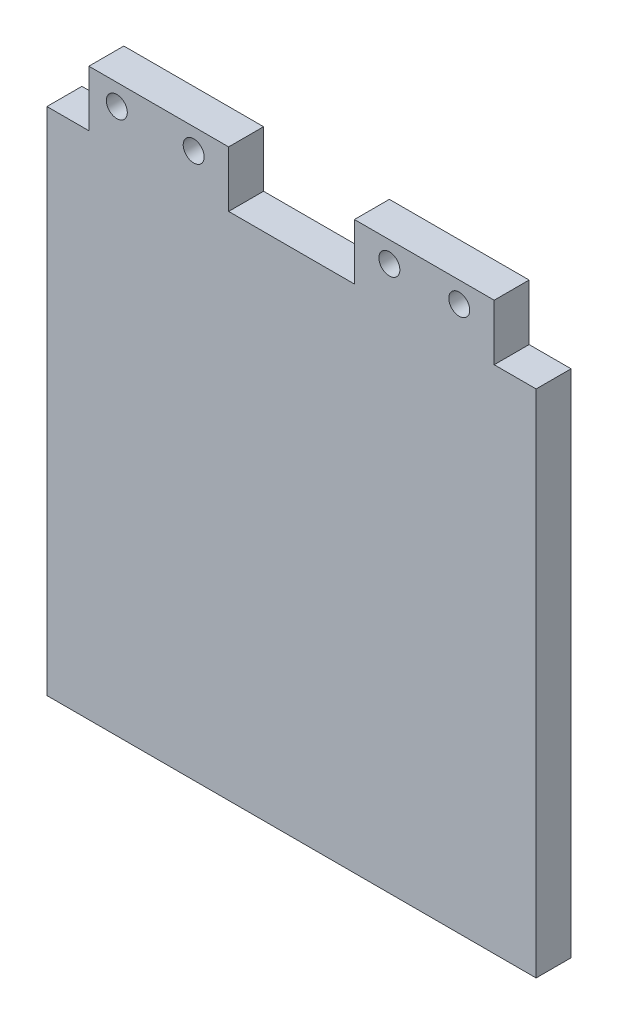
ISO-10303-21;
HEADER;
FILE_DESCRIPTION(('STEP AP214'),'2;1');
FILE_NAME('part.step','',(''),(''),'','','');
FILE_SCHEMA(('AUTOMOTIVE_DESIGN { 1 0 10303 214 1 1 1 1 }'));
ENDSEC;
DATA;
#1=APPLICATION_CONTEXT('core data for automotive mechanical design processes');
#2=APPLICATION_PROTOCOL_DEFINITION('international standard','automotive_design',2000,#1);
#3=PRODUCT_CONTEXT('',#1,'mechanical');
#4=PRODUCT('Part','Part','',(#3));
#5=PRODUCT_RELATED_PRODUCT_CATEGORY('part','',(#4));
#6=PRODUCT_DEFINITION_FORMATION('','',#4);
#7=PRODUCT_DEFINITION_CONTEXT('part definition',#1,'design');
#8=PRODUCT_DEFINITION('design','',#6,#7);
#9=PRODUCT_DEFINITION_SHAPE('','',#8);
#10=(LENGTH_UNIT() NAMED_UNIT(*) SI_UNIT(.MILLI.,.METRE.));
#11=(NAMED_UNIT(*) PLANE_ANGLE_UNIT() SI_UNIT($,.RADIAN.));
#12=(NAMED_UNIT(*) SI_UNIT($,.STERADIAN.) SOLID_ANGLE_UNIT());
#13=UNCERTAINTY_MEASURE_WITH_UNIT(LENGTH_MEASURE(1.E-05),#10,'distance_accuracy_value','');
#14=(GEOMETRIC_REPRESENTATION_CONTEXT(3) GLOBAL_UNCERTAINTY_ASSIGNED_CONTEXT((#13)) GLOBAL_UNIT_ASSIGNED_CONTEXT((#10,
#11,#12)) REPRESENTATION_CONTEXT('',''));
#15=CARTESIAN_POINT('',(0.,0.,0.));
#16=DIRECTION('',(0.,0.,1.));
#17=DIRECTION('',(1.,0.,0.));
#18=AXIS2_PLACEMENT_3D('',#15,#16,#17);
#19=CARTESIAN_POINT('',(-1.55698672911795,38.1428571428572,5.));
#20=DIRECTION('',(-1.,0.,0.));
#21=DIRECTION('',(0.,0.,1.));
#22=AXIS2_PLACEMENT_3D('',#19,#20,#21);
#23=PLANE('',#22);
#24=DIRECTION('',(0.,1.,0.));
#25=VECTOR('',#24,1.);
#26=CARTESIAN_POINT('',(-1.55698672911795,38.1428571428572,0.));
#27=LINE('',#26,#25);
#28=CARTESIAN_POINT('',(-1.55698672911795,38.1428571428572,0.));
#29=VERTEX_POINT('',#28);
#30=CARTESIAN_POINT('',(-1.55698672911795,46.1428571428572,0.));
#31=VERTEX_POINT('',#30);
#32=EDGE_CURVE('E154',#29,#31,#27,.T.);
#33=ORIENTED_EDGE('',*,*,#32,.T.);
#34=DIRECTION('',(0.,0.,-1.));
#35=VECTOR('',#34,1.);
#36=CARTESIAN_POINT('',(-1.55698672911795,46.1428571428572,5.));
#37=LINE('',#36,#35);
#38=CARTESIAN_POINT('',(-1.55698672911795,46.1428571428572,5.));
#39=VERTEX_POINT('',#38);
#40=EDGE_CURVE('E11',#39,#31,#37,.T.);
#41=ORIENTED_EDGE('',*,*,#40,.F.);
#42=DIRECTION('',(0.,1.,0.));
#43=VECTOR('',#42,1.);
#44=CARTESIAN_POINT('',(-1.55698672911795,38.1428571428572,5.));
#45=LINE('',#44,#43);
#46=CARTESIAN_POINT('',(-1.55698672911795,38.1428571428572,5.));
#47=VERTEX_POINT('',#46);
#48=EDGE_CURVE('E100',#47,#39,#45,.T.);
#49=ORIENTED_EDGE('',*,*,#48,.F.);
#50=DIRECTION('',(0.,0.,-1.));
#51=VECTOR('',#50,1.);
#52=CARTESIAN_POINT('',(-1.55698672911795,38.1428571428572,5.));
#53=LINE('',#52,#51);
#54=EDGE_CURVE('E51',#47,#29,#53,.T.);
#55=ORIENTED_EDGE('',*,*,#54,.T.);
#56=EDGE_LOOP('',(#33,#41,#49,#55));
#57=FACE_BOUND('',#56,.T.);
#58=ADVANCED_FACE('F33',(#57),#23,.F.);
#59=CARTESIAN_POINT('',(-21.5569867291179,46.1428571428572,5.));
#60=DIRECTION('',(0.,1.,0.));
#61=DIRECTION('',(0.,0.,1.));
#62=AXIS2_PLACEMENT_3D('',#59,#60,#61);
#63=PLANE('',#62);
#64=DIRECTION('',(1.,0.,0.));
#65=VECTOR('',#64,1.);
#66=CARTESIAN_POINT('',(-21.5569867291179,46.1428571428572,0.));
#67=LINE('',#66,#65);
#68=CARTESIAN_POINT('',(-21.5569867291179,46.1428571428572,0.));
#69=VERTEX_POINT('',#68);
#70=EDGE_CURVE('E156',#69,#31,#67,.T.);
#71=ORIENTED_EDGE('',*,*,#70,.F.);
#72=DIRECTION('',(0.,0.,-1.));
#73=VECTOR('',#72,1.);
#74=CARTESIAN_POINT('',(-21.5569867291179,46.1428571428572,5.));
#75=LINE('',#74,#73);
#76=CARTESIAN_POINT('',(-21.5569867291179,46.1428571428572,5.));
#77=VERTEX_POINT('',#76);
#78=EDGE_CURVE('E42',#77,#69,#75,.T.);
#79=ORIENTED_EDGE('',*,*,#78,.F.);
#80=DIRECTION('',(1.,0.,0.));
#81=VECTOR('',#80,1.);
#82=CARTESIAN_POINT('',(-21.5569867291179,46.1428571428572,5.));
#83=LINE('',#82,#81);
#84=EDGE_CURVE('E216',#77,#39,#83,.T.);
#85=ORIENTED_EDGE('',*,*,#84,.T.);
#86=ORIENTED_EDGE('',*,*,#40,.T.);
#87=EDGE_LOOP('',(#71,#79,#85,#86));
#88=FACE_BOUND('',#87,.T.);
#89=ADVANCED_FACE('F260',(#88),#63,.T.);
#90=CARTESIAN_POINT('',(-21.5569867291179,38.1428571428572,5.));
#91=DIRECTION('',(-1.,0.,0.));
#92=DIRECTION('',(0.,-1.,0.));
#93=AXIS2_PLACEMENT_3D('',#90,#91,#92);
#94=PLANE('',#93);
#95=DIRECTION('',(0.,1.,0.));
#96=VECTOR('',#95,1.);
#97=CARTESIAN_POINT('',(-21.5569867291179,38.1428571428572,0.));
#98=LINE('',#97,#96);
#99=CARTESIAN_POINT('',(-21.5569867291179,38.1428571428572,0.));
#100=VERTEX_POINT('',#99);
#101=EDGE_CURVE('E160',#100,#69,#98,.T.);
#102=ORIENTED_EDGE('',*,*,#101,.F.);
#103=DIRECTION('',(0.,0.,-1.));
#104=VECTOR('',#103,1.);
#105=CARTESIAN_POINT('',(-21.5569867291179,38.1428571428572,5.));
#106=LINE('',#105,#104);
#107=CARTESIAN_POINT('',(-21.5569867291179,38.1428571428572,5.));
#108=VERTEX_POINT('',#107);
#109=EDGE_CURVE('E200',#108,#100,#106,.T.);
#110=ORIENTED_EDGE('',*,*,#109,.F.);
#111=DIRECTION('',(0.,1.,0.));
#112=VECTOR('',#111,1.);
#113=CARTESIAN_POINT('',(-21.5569867291179,38.1428571428572,5.));
#114=LINE('',#113,#112);
#115=EDGE_CURVE('E219',#108,#77,#114,.T.);
#116=ORIENTED_EDGE('',*,*,#115,.T.);
#117=ORIENTED_EDGE('',*,*,#78,.T.);
#118=EDGE_LOOP('',(#102,#110,#116,#117));
#119=FACE_BOUND('',#118,.T.);
#120=ADVANCED_FACE('F264',(#119),#94,.T.);
#121=CARTESIAN_POINT('',(-27.5569867291179,38.1428571428572,5.));
#122=DIRECTION('',(0.,1.,0.));
#123=DIRECTION('',(0.,0.,1.));
#124=AXIS2_PLACEMENT_3D('',#121,#122,#123);
#125=PLANE('',#124);
#126=DIRECTION('',(1.,0.,0.));
#127=VECTOR('',#126,1.);
#128=CARTESIAN_POINT('',(-27.5569867291179,38.1428571428572,0.));
#129=LINE('',#128,#127);
#130=CARTESIAN_POINT('',(-27.5569867291179,38.1428571428572,0.));
#131=VERTEX_POINT('',#130);
#132=EDGE_CURVE('E163',#131,#100,#129,.T.);
#133=ORIENTED_EDGE('',*,*,#132,.F.);
#134=DIRECTION('',(0.,0.,-1.));
#135=VECTOR('',#134,1.);
#136=CARTESIAN_POINT('',(-27.5569867291179,38.1428571428572,5.));
#137=LINE('',#136,#135);
#138=CARTESIAN_POINT('',(-27.5569867291179,38.1428571428572,5.));
#139=VERTEX_POINT('',#138);
#140=EDGE_CURVE('E198',#139,#131,#137,.T.);
#141=ORIENTED_EDGE('',*,*,#140,.F.);
#142=DIRECTION('',(1.,0.,0.));
#143=VECTOR('',#142,1.);
#144=CARTESIAN_POINT('',(-27.5569867291179,38.1428571428572,5.));
#145=LINE('',#144,#143);
#146=EDGE_CURVE('E222',#139,#108,#145,.T.);
#147=ORIENTED_EDGE('',*,*,#146,.T.);
#148=ORIENTED_EDGE('',*,*,#109,.T.);
#149=EDGE_LOOP('',(#133,#141,#147,#148));
#150=FACE_BOUND('',#149,.T.);
#151=ADVANCED_FACE('F273',(#150),#125,.T.);
#152=CARTESIAN_POINT('',(-27.5569867291179,-34.8571428571428,5.));
#153=DIRECTION('',(-1.,0.,0.));
#154=DIRECTION('',(0.,0.,1.));
#155=AXIS2_PLACEMENT_3D('',#152,#153,#154);
#156=PLANE('',#155);
#157=DIRECTION('',(0.,1.,0.));
#158=VECTOR('',#157,1.);
#159=CARTESIAN_POINT('',(-27.5569867291179,-34.8571428571428,0.));
#160=LINE('',#159,#158);
#161=CARTESIAN_POINT('',(-27.5569867291179,-34.8571428571428,0.));
#162=VERTEX_POINT('',#161);
#163=EDGE_CURVE('E166',#162,#131,#160,.T.);
#164=ORIENTED_EDGE('',*,*,#163,.F.);
#165=DIRECTION('',(0.,0.,-1.));
#166=VECTOR('',#165,1.);
#167=CARTESIAN_POINT('',(-27.5569867291179,-34.8571428571428,5.));
#168=LINE('',#167,#166);
#169=CARTESIAN_POINT('',(-27.5569867291179,-34.8571428571428,5.));
#170=VERTEX_POINT('',#169);
#171=EDGE_CURVE('E196',#170,#162,#168,.T.);
#172=ORIENTED_EDGE('',*,*,#171,.F.);
#173=DIRECTION('',(0.,1.,0.));
#174=VECTOR('',#173,1.);
#175=CARTESIAN_POINT('',(-27.5569867291179,-34.8571428571428,5.));
#176=LINE('',#175,#174);
#177=EDGE_CURVE('E225',#170,#139,#176,.T.);
#178=ORIENTED_EDGE('',*,*,#177,.T.);
#179=ORIENTED_EDGE('',*,*,#140,.T.);
#180=EDGE_LOOP('',(#164,#172,#178,#179));
#181=FACE_BOUND('',#180,.T.);
#182=ADVANCED_FACE('F276',(#181),#156,.T.);
#183=CARTESIAN_POINT('',(-27.5569867291179,-34.8571428571428,5.));
#184=DIRECTION('',(0.,1.,0.));
#185=DIRECTION('',(0.,0.,1.));
#186=AXIS2_PLACEMENT_3D('',#183,#184,#185);
#187=PLANE('',#186);
#188=DIRECTION('',(1.,0.,0.));
#189=VECTOR('',#188,1.);
#190=CARTESIAN_POINT('',(-27.5569867291179,-34.8571428571428,0.));
#191=LINE('',#190,#189);
#192=CARTESIAN_POINT('',(42.4430132708821,-34.8571428571428,0.));
#193=VERTEX_POINT('',#192);
#194=EDGE_CURVE('E169',#162,#193,#191,.T.);
#195=ORIENTED_EDGE('',*,*,#194,.T.);
#196=DIRECTION('',(0.,0.,-1.));
#197=VECTOR('',#196,1.);
#198=CARTESIAN_POINT('',(42.4430132708821,-34.8571428571428,5.));
#199=LINE('',#198,#197);
#200=CARTESIAN_POINT('',(42.4430132708821,-34.8571428571428,5.));
#201=VERTEX_POINT('',#200);
#202=EDGE_CURVE('E193',#201,#193,#199,.T.);
#203=ORIENTED_EDGE('',*,*,#202,.F.);
#204=DIRECTION('',(1.,0.,0.));
#205=VECTOR('',#204,1.);
#206=CARTESIAN_POINT('',(-27.5569867291179,-34.8571428571428,5.));
#207=LINE('',#206,#205);
#208=EDGE_CURVE('E228',#170,#201,#207,.T.);
#209=ORIENTED_EDGE('',*,*,#208,.F.);
#210=ORIENTED_EDGE('',*,*,#171,.T.);
#211=EDGE_LOOP('',(#195,#203,#209,#210));
#212=FACE_BOUND('',#211,.T.);
#213=ADVANCED_FACE('F278',(#212),#187,.F.);
#214=CARTESIAN_POINT('',(42.4430132708821,-34.8571428571428,5.));
#215=DIRECTION('',(-1.,0.,0.));
#216=DIRECTION('',(0.,0.,1.));
#217=AXIS2_PLACEMENT_3D('',#214,#215,#216);
#218=PLANE('',#217);
#219=DIRECTION('',(0.,1.,0.));
#220=VECTOR('',#219,1.);
#221=CARTESIAN_POINT('',(42.4430132708821,-34.8571428571428,0.));
#222=LINE('',#221,#220);
#223=CARTESIAN_POINT('',(42.4430132708821,38.1428571428572,0.));
#224=VERTEX_POINT('',#223);
#225=EDGE_CURVE('E171',#193,#224,#222,.T.);
#226=ORIENTED_EDGE('',*,*,#225,.T.);
#227=DIRECTION('',(0.,0.,-1.));
#228=VECTOR('',#227,1.);
#229=CARTESIAN_POINT('',(42.4430132708821,38.1428571428572,5.));
#230=LINE('',#229,#228);
#231=CARTESIAN_POINT('',(42.4430132708821,38.1428571428572,5.));
#232=VERTEX_POINT('',#231);
#233=EDGE_CURVE('E191',#232,#224,#230,.T.);
#234=ORIENTED_EDGE('',*,*,#233,.F.);
#235=DIRECTION('',(0.,1.,0.));
#236=VECTOR('',#235,1.);
#237=CARTESIAN_POINT('',(42.4430132708821,-34.8571428571428,5.));
#238=LINE('',#237,#236);
#239=EDGE_CURVE('E230',#201,#232,#238,.T.);
#240=ORIENTED_EDGE('',*,*,#239,.F.);
#241=ORIENTED_EDGE('',*,*,#202,.T.);
#242=EDGE_LOOP('',(#226,#234,#240,#241));
#243=FACE_BOUND('',#242,.T.);
#244=ADVANCED_FACE('F243',(#243),#218,.F.);
#245=CARTESIAN_POINT('',(36.4430132708821,38.1428571428572,5.));
#246=DIRECTION('',(0.,1.,0.));
#247=DIRECTION('',(0.,0.,1.));
#248=AXIS2_PLACEMENT_3D('',#245,#246,#247);
#249=PLANE('',#248);
#250=DIRECTION('',(1.,0.,0.));
#251=VECTOR('',#250,1.);
#252=CARTESIAN_POINT('',(36.4430132708821,38.1428571428572,0.));
#253=LINE('',#252,#251);
#254=CARTESIAN_POINT('',(36.4430132708821,38.1428571428572,0.));
#255=VERTEX_POINT('',#254);
#256=EDGE_CURVE('E174',#255,#224,#253,.T.);
#257=ORIENTED_EDGE('',*,*,#256,.F.);
#258=DIRECTION('',(0.,0.,-1.));
#259=VECTOR('',#258,1.);
#260=CARTESIAN_POINT('',(36.4430132708821,38.1428571428572,5.));
#261=LINE('',#260,#259);
#262=CARTESIAN_POINT('',(36.4430132708821,38.1428571428572,5.));
#263=VERTEX_POINT('',#262);
#264=EDGE_CURVE('E189',#263,#255,#261,.T.);
#265=ORIENTED_EDGE('',*,*,#264,.F.);
#266=DIRECTION('',(1.,0.,0.));
#267=VECTOR('',#266,1.);
#268=CARTESIAN_POINT('',(36.4430132708821,38.1428571428572,5.));
#269=LINE('',#268,#267);
#270=EDGE_CURVE('E232',#263,#232,#269,.T.);
#271=ORIENTED_EDGE('',*,*,#270,.T.);
#272=ORIENTED_EDGE('',*,*,#233,.T.);
#273=EDGE_LOOP('',(#257,#265,#271,#272));
#274=FACE_BOUND('',#273,.T.);
#275=ADVANCED_FACE('F236',(#274),#249,.T.);
#276=CARTESIAN_POINT('',(36.4430132708821,38.1428571428572,5.));
#277=DIRECTION('',(-1.,0.,0.));
#278=DIRECTION('',(0.,0.,1.));
#279=AXIS2_PLACEMENT_3D('',#276,#277,#278);
#280=PLANE('',#279);
#281=DIRECTION('',(0.,1.,0.));
#282=VECTOR('',#281,1.);
#283=CARTESIAN_POINT('',(36.4430132708821,38.1428571428572,0.));
#284=LINE('',#283,#282);
#285=CARTESIAN_POINT('',(36.4430132708821,46.1428571428572,0.));
#286=VERTEX_POINT('',#285);
#287=EDGE_CURVE('E177',#255,#286,#284,.T.);
#288=ORIENTED_EDGE('',*,*,#287,.T.);
#289=DIRECTION('',(0.,0.,-1.));
#290=VECTOR('',#289,1.);
#291=CARTESIAN_POINT('',(36.4430132708821,46.1428571428572,5.));
#292=LINE('',#291,#290);
#293=CARTESIAN_POINT('',(36.4430132708821,46.1428571428572,5.));
#294=VERTEX_POINT('',#293);
#295=EDGE_CURVE('E138',#294,#286,#292,.T.);
#296=ORIENTED_EDGE('',*,*,#295,.F.);
#297=DIRECTION('',(0.,1.,0.));
#298=VECTOR('',#297,1.);
#299=CARTESIAN_POINT('',(36.4430132708821,38.1428571428572,5.));
#300=LINE('',#299,#298);
#301=EDGE_CURVE('E145',#263,#294,#300,.T.);
#302=ORIENTED_EDGE('',*,*,#301,.F.);
#303=ORIENTED_EDGE('',*,*,#264,.T.);
#304=EDGE_LOOP('',(#288,#296,#302,#303));
#305=FACE_BOUND('',#304,.T.);
#306=ADVANCED_FACE('F250',(#305),#280,.F.);
#307=CARTESIAN_POINT('',(16.4430132708821,46.1428571428572,5.));
#308=DIRECTION('',(0.,1.,0.));
#309=DIRECTION('',(0.,0.,1.));
#310=AXIS2_PLACEMENT_3D('',#307,#308,#309);
#311=PLANE('',#310);
#312=DIRECTION('',(1.,0.,0.));
#313=VECTOR('',#312,1.);
#314=CARTESIAN_POINT('',(16.4430132708821,46.1428571428572,0.));
#315=LINE('',#314,#313);
#316=CARTESIAN_POINT('',(16.4430132708821,46.1428571428572,0.));
#317=VERTEX_POINT('',#316);
#318=EDGE_CURVE('E134',#317,#286,#315,.T.);
#319=ORIENTED_EDGE('',*,*,#318,.F.);
#320=DIRECTION('',(0.,0.,-1.));
#321=VECTOR('',#320,1.);
#322=CARTESIAN_POINT('',(16.4430132708821,46.1428571428572,5.));
#323=LINE('',#322,#321);
#324=CARTESIAN_POINT('',(16.4430132708821,46.1428571428572,5.));
#325=VERTEX_POINT('',#324);
#326=EDGE_CURVE('E129',#325,#317,#323,.T.);
#327=ORIENTED_EDGE('',*,*,#326,.F.);
#328=DIRECTION('',(1.,0.,0.));
#329=VECTOR('',#328,1.);
#330=CARTESIAN_POINT('',(16.4430132708821,46.1428571428572,5.));
#331=LINE('',#330,#329);
#332=EDGE_CURVE('E132',#325,#294,#331,.T.);
#333=ORIENTED_EDGE('',*,*,#332,.T.);
#334=ORIENTED_EDGE('',*,*,#295,.T.);
#335=EDGE_LOOP('',(#319,#327,#333,#334));
#336=FACE_BOUND('',#335,.T.);
#337=ADVANCED_FACE('F131',(#336),#311,.T.);
#338=CARTESIAN_POINT('',(16.4430132708821,38.1428571428572,5.));
#339=DIRECTION('',(-1.,0.,0.));
#340=DIRECTION('',(0.,0.,1.));
#341=AXIS2_PLACEMENT_3D('',#338,#339,#340);
#342=PLANE('',#341);
#343=DIRECTION('',(0.,1.,0.));
#344=VECTOR('',#343,1.);
#345=CARTESIAN_POINT('',(16.4430132708821,38.1428571428572,0.));
#346=LINE('',#345,#344);
#347=CARTESIAN_POINT('',(16.4430132708821,38.1428571428572,0.));
#348=VERTEX_POINT('',#347);
#349=EDGE_CURVE('E181',#348,#317,#346,.T.);
#350=ORIENTED_EDGE('',*,*,#349,.F.);
#351=DIRECTION('',(0.,0.,-1.));
#352=VECTOR('',#351,1.);
#353=CARTESIAN_POINT('',(16.4430132708821,38.1428571428572,5.));
#354=LINE('',#353,#352);
#355=CARTESIAN_POINT('',(16.4430132708821,38.1428571428572,5.));
#356=VERTEX_POINT('',#355);
#357=EDGE_CURVE('E88',#356,#348,#354,.T.);
#358=ORIENTED_EDGE('',*,*,#357,.F.);
#359=DIRECTION('',(0.,1.,0.));
#360=VECTOR('',#359,1.);
#361=CARTESIAN_POINT('',(16.4430132708821,38.1428571428572,5.));
#362=LINE('',#361,#360);
#363=EDGE_CURVE('E142',#356,#325,#362,.T.);
#364=ORIENTED_EDGE('',*,*,#363,.T.);
#365=ORIENTED_EDGE('',*,*,#326,.T.);
#366=EDGE_LOOP('',(#350,#358,#364,#365));
#367=FACE_BOUND('',#366,.T.);
#368=ADVANCED_FACE('F148',(#367),#342,.T.);
#369=CARTESIAN_POINT('',(-1.55698672911795,38.1428571428572,5.));
#370=DIRECTION('',(0.,1.,0.));
#371=DIRECTION('',(0.,0.,1.));
#372=AXIS2_PLACEMENT_3D('',#369,#370,#371);
#373=PLANE('',#372);
#374=DIRECTION('',(1.,0.,0.));
#375=VECTOR('',#374,1.);
#376=CARTESIAN_POINT('',(-1.55698672911795,38.1428571428572,0.));
#377=LINE('',#376,#375);
#378=EDGE_CURVE('E183',#29,#348,#377,.T.);
#379=ORIENTED_EDGE('',*,*,#378,.F.);
#380=ORIENTED_EDGE('',*,*,#54,.F.);
#381=DIRECTION('',(1.,0.,0.));
#382=VECTOR('',#381,1.);
#383=CARTESIAN_POINT('',(-1.55698672911795,38.1428571428572,5.));
#384=LINE('',#383,#382);
#385=EDGE_CURVE('E149',#47,#356,#384,.T.);
#386=ORIENTED_EDGE('',*,*,#385,.T.);
#387=ORIENTED_EDGE('',*,*,#357,.T.);
#388=EDGE_LOOP('',(#379,#380,#386,#387));
#389=FACE_BOUND('',#388,.T.);
#390=ADVANCED_FACE('F338',(#389),#373,.T.);
#391=CARTESIAN_POINT('',(0.,0.,5.));
#392=DIRECTION('',(0.,0.,-1.));
#393=DIRECTION('',(-1.,0.,0.));
#394=AXIS2_PLACEMENT_3D('',#391,#392,#393);
#395=PLANE('',#394);
#396=CARTESIAN_POINT('',(31.4430132708821,43.1428571428572,5.));
#397=DIRECTION('',(0.,0.,1.));
#398=DIRECTION('',(1.,0.,0.));
#399=AXIS2_PLACEMENT_3D('',#396,#397,#398);
#400=CIRCLE('',#399,1.5);
#401=CARTESIAN_POINT('',(32.9430132708821,43.1428571428572,5.));
#402=VERTEX_POINT('',#401);
#403=EDGE_CURVE('E413',#402,#402,#400,.T.);
#404=ORIENTED_EDGE('',*,*,#403,.F.);
#405=EDGE_LOOP('',(#404));
#406=FACE_BOUND('',#405,.T.);
#407=CARTESIAN_POINT('',(21.4430132708821,43.1428571428572,5.));
#408=DIRECTION('',(0.,0.,1.));
#409=DIRECTION('',(1.,0.,0.));
#410=AXIS2_PLACEMENT_3D('',#407,#408,#409);
#411=CIRCLE('',#410,1.5);
#412=CARTESIAN_POINT('',(22.9430132708821,43.1428571428572,5.));
#413=VERTEX_POINT('',#412);
#414=EDGE_CURVE('E415',#413,#413,#411,.T.);
#415=ORIENTED_EDGE('',*,*,#414,.F.);
#416=EDGE_LOOP('',(#415));
#417=FACE_BOUND('',#416,.T.);
#418=CARTESIAN_POINT('',(-6.55698672911795,43.1428571428572,5.));
#419=DIRECTION('',(0.,0.,1.));
#420=DIRECTION('',(1.,0.,0.));
#421=AXIS2_PLACEMENT_3D('',#418,#419,#420);
#422=CIRCLE('',#421,1.5);
#423=CARTESIAN_POINT('',(-5.05698672911795,43.1428571428572,5.));
#424=VERTEX_POINT('',#423);
#425=EDGE_CURVE('E211',#424,#424,#422,.T.);
#426=ORIENTED_EDGE('',*,*,#425,.F.);
#427=EDGE_LOOP('',(#426));
#428=FACE_BOUND('',#427,.T.);
#429=CARTESIAN_POINT('',(-17.5569867291179,43.1428571428572,5.));
#430=DIRECTION('',(0.,0.,1.));
#431=DIRECTION('',(1.,0.,0.));
#432=AXIS2_PLACEMENT_3D('',#429,#430,#431);
#433=CIRCLE('',#432,1.5);
#434=CARTESIAN_POINT('',(-16.0569867291179,43.1428571428572,5.));
#435=VERTEX_POINT('',#434);
#436=EDGE_CURVE('E203',#435,#435,#433,.T.);
#437=ORIENTED_EDGE('',*,*,#436,.F.);
#438=EDGE_LOOP('',(#437));
#439=FACE_BOUND('',#438,.T.);
#440=ORIENTED_EDGE('',*,*,#48,.T.);
#441=ORIENTED_EDGE('',*,*,#84,.F.);
#442=ORIENTED_EDGE('',*,*,#115,.F.);
#443=ORIENTED_EDGE('',*,*,#146,.F.);
#444=ORIENTED_EDGE('',*,*,#177,.F.);
#445=ORIENTED_EDGE('',*,*,#208,.T.);
#446=ORIENTED_EDGE('',*,*,#239,.T.);
#447=ORIENTED_EDGE('',*,*,#270,.F.);
#448=ORIENTED_EDGE('',*,*,#301,.T.);
#449=ORIENTED_EDGE('',*,*,#332,.F.);
#450=ORIENTED_EDGE('',*,*,#363,.F.);
#451=ORIENTED_EDGE('',*,*,#385,.F.);
#452=EDGE_LOOP('',(#440,#441,#442,#443,#444,#445,#446,#447,#448,#449,#450,#451));
#453=FACE_BOUND('',#452,.T.);
#454=ADVANCED_FACE('F141',(#406,#417,#428,#439,#453),#395,.F.);
#455=CARTESIAN_POINT('',(0.,0.,0.));
#456=DIRECTION('',(0.,0.,-1.));
#457=DIRECTION('',(-1.,0.,0.));
#458=AXIS2_PLACEMENT_3D('',#455,#456,#457);
#459=PLANE('',#458);
#460=CARTESIAN_POINT('',(31.4430132708821,43.1428571428572,0.));
#461=DIRECTION('',(0.,0.,1.));
#462=DIRECTION('',(1.,0.,0.));
#463=AXIS2_PLACEMENT_3D('',#460,#461,#462);
#464=CIRCLE('',#463,1.5);
#465=CARTESIAN_POINT('',(32.9430132708821,43.1428571428572,0.));
#466=VERTEX_POINT('',#465);
#467=EDGE_CURVE('E410',#466,#466,#464,.T.);
#468=ORIENTED_EDGE('',*,*,#467,.T.);
#469=EDGE_LOOP('',(#468));
#470=FACE_BOUND('',#469,.T.);
#471=CARTESIAN_POINT('',(21.4430132708821,43.1428571428572,0.));
#472=DIRECTION('',(0.,0.,1.));
#473=DIRECTION('',(1.,0.,0.));
#474=AXIS2_PLACEMENT_3D('',#471,#472,#473);
#475=CIRCLE('',#474,1.5);
#476=CARTESIAN_POINT('',(22.9430132708821,43.1428571428572,0.));
#477=VERTEX_POINT('',#476);
#478=EDGE_CURVE('E418',#477,#477,#475,.T.);
#479=ORIENTED_EDGE('',*,*,#478,.T.);
#480=EDGE_LOOP('',(#479));
#481=FACE_BOUND('',#480,.T.);
#482=CARTESIAN_POINT('',(-6.55698672911795,43.1428571428572,0.));
#483=DIRECTION('',(0.,0.,-1.));
#484=DIRECTION('',(-1.,0.,0.));
#485=AXIS2_PLACEMENT_3D('',#482,#483,#484);
#486=CIRCLE('',#485,1.5);
#487=CARTESIAN_POINT('',(-8.05698672911795,43.1428571428572,0.));
#488=VERTEX_POINT('',#487);
#489=EDGE_CURVE('E36',#488,#488,#486,.T.);
#490=ORIENTED_EDGE('',*,*,#489,.F.);
#491=EDGE_LOOP('',(#490));
#492=FACE_BOUND('',#491,.T.);
#493=CARTESIAN_POINT('',(-17.5569867291179,43.1428571428572,0.));
#494=DIRECTION('',(0.,0.,-1.));
#495=DIRECTION('',(-1.,0.,0.));
#496=AXIS2_PLACEMENT_3D('',#493,#494,#495);
#497=CIRCLE('',#496,1.5);
#498=CARTESIAN_POINT('',(-19.0569867291179,43.1428571428572,0.));
#499=VERTEX_POINT('',#498);
#500=EDGE_CURVE('E157',#499,#499,#497,.T.);
#501=ORIENTED_EDGE('',*,*,#500,.F.);
#502=EDGE_LOOP('',(#501));
#503=FACE_BOUND('',#502,.T.);
#504=ORIENTED_EDGE('',*,*,#32,.F.);
#505=ORIENTED_EDGE('',*,*,#378,.T.);
#506=ORIENTED_EDGE('',*,*,#349,.T.);
#507=ORIENTED_EDGE('',*,*,#318,.T.);
#508=ORIENTED_EDGE('',*,*,#287,.F.);
#509=ORIENTED_EDGE('',*,*,#256,.T.);
#510=ORIENTED_EDGE('',*,*,#225,.F.);
#511=ORIENTED_EDGE('',*,*,#194,.F.);
#512=ORIENTED_EDGE('',*,*,#163,.T.);
#513=ORIENTED_EDGE('',*,*,#132,.T.);
#514=ORIENTED_EDGE('',*,*,#101,.T.);
#515=ORIENTED_EDGE('',*,*,#70,.T.);
#516=EDGE_LOOP('',(#504,#505,#506,#507,#508,#509,#510,#511,#512,#513,#514,#515));
#517=FACE_BOUND('',#516,.T.);
#518=ADVANCED_FACE('F248',(#470,#481,#492,#503,#517),#459,.T.);
#519=CARTESIAN_POINT('',(-17.5569867291179,43.1428571428572,-5.));
#520=DIRECTION('',(0.,0.,1.));
#521=DIRECTION('',(1.,0.,0.));
#522=AXIS2_PLACEMENT_3D('',#519,#520,#521);
#523=CYLINDRICAL_SURFACE('',#522,1.5);
#524=ORIENTED_EDGE('',*,*,#500,.T.);
#525=EDGE_LOOP('',(#524));
#526=FACE_BOUND('',#525,.T.);
#527=ORIENTED_EDGE('',*,*,#436,.T.);
#528=EDGE_LOOP('',(#527));
#529=FACE_BOUND('',#528,.T.);
#530=ADVANCED_FACE('F353',(#526,#529),#523,.F.);
#531=CARTESIAN_POINT('',(-6.55698672911795,43.1428571428572,-5.));
#532=DIRECTION('',(0.,0.,1.));
#533=DIRECTION('',(1.,0.,0.));
#534=AXIS2_PLACEMENT_3D('',#531,#532,#533);
#535=CYLINDRICAL_SURFACE('',#534,1.5);
#536=ORIENTED_EDGE('',*,*,#489,.T.);
#537=EDGE_LOOP('',(#536));
#538=FACE_BOUND('',#537,.T.);
#539=ORIENTED_EDGE('',*,*,#425,.T.);
#540=EDGE_LOOP('',(#539));
#541=FACE_BOUND('',#540,.T.);
#542=ADVANCED_FACE('F358',(#538,#541),#535,.F.);
#543=CARTESIAN_POINT('',(21.4430132708821,43.1428571428572,0.));
#544=DIRECTION('',(0.,0.,1.));
#545=DIRECTION('',(1.,0.,0.));
#546=AXIS2_PLACEMENT_3D('',#543,#544,#545);
#547=CYLINDRICAL_SURFACE('',#546,1.5);
#548=ORIENTED_EDGE('',*,*,#478,.F.);
#549=EDGE_LOOP('',(#548));
#550=FACE_BOUND('',#549,.T.);
#551=ORIENTED_EDGE('',*,*,#414,.T.);
#552=EDGE_LOOP('',(#551));
#553=FACE_BOUND('',#552,.T.);
#554=ADVANCED_FACE('F369',(#550,#553),#547,.F.);
#555=CARTESIAN_POINT('',(31.4430132708821,43.1428571428572,0.));
#556=DIRECTION('',(0.,0.,1.));
#557=DIRECTION('',(1.,0.,0.));
#558=AXIS2_PLACEMENT_3D('',#555,#556,#557);
#559=CYLINDRICAL_SURFACE('',#558,1.5);
#560=ORIENTED_EDGE('',*,*,#467,.F.);
#561=EDGE_LOOP('',(#560));
#562=FACE_BOUND('',#561,.T.);
#563=ORIENTED_EDGE('',*,*,#403,.T.);
#564=EDGE_LOOP('',(#563));
#565=FACE_BOUND('',#564,.T.);
#566=ADVANCED_FACE('F393',(#562,#565),#559,.F.);
#567=CLOSED_SHELL('',(#58,#89,#120,#151,#182,#213,#244,#275,#306,#337,#368,#390,#454,#518,#530,
#542,#554,#566));
#568=MANIFOLD_SOLID_BREP('B2',#567);
#569=ADVANCED_BREP_SHAPE_REPRESENTATION('',(#18,#568),#14);
#570=SHAPE_DEFINITION_REPRESENTATION(#9,#569);
ENDSEC;
END-ISO-10303-21;
